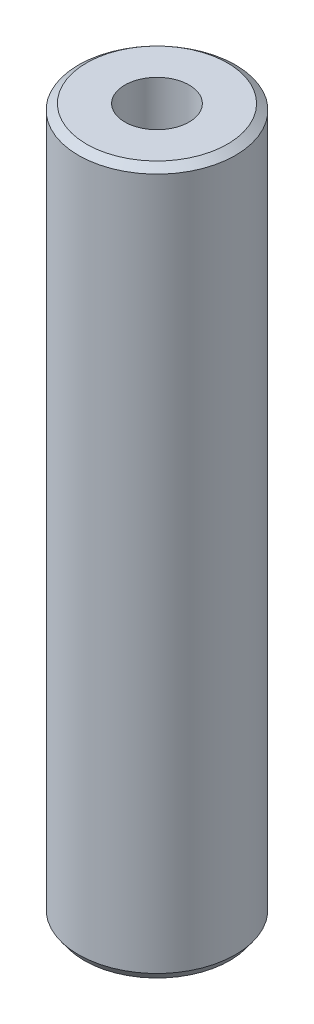
ISO-10303-21;
HEADER;
FILE_DESCRIPTION(('STEP AP214'),'2;1');
FILE_NAME('part.step','',(''),(''),'','','');
FILE_SCHEMA(('AUTOMOTIVE_DESIGN { 1 0 10303 214 1 1 1 1 }'));
ENDSEC;
DATA;
#1=APPLICATION_CONTEXT('core data for automotive mechanical design processes');
#2=APPLICATION_PROTOCOL_DEFINITION('international standard','automotive_design',2000,#1);
#3=PRODUCT_CONTEXT('',#1,'mechanical');
#4=PRODUCT('Part','Part','',(#3));
#5=PRODUCT_RELATED_PRODUCT_CATEGORY('part','',(#4));
#6=PRODUCT_DEFINITION_FORMATION('','',#4);
#7=PRODUCT_DEFINITION_CONTEXT('part definition',#1,'design');
#8=PRODUCT_DEFINITION('design','',#6,#7);
#9=PRODUCT_DEFINITION_SHAPE('','',#8);
#10=(LENGTH_UNIT() NAMED_UNIT(*) SI_UNIT(.MILLI.,.METRE.));
#11=(NAMED_UNIT(*) PLANE_ANGLE_UNIT() SI_UNIT($,.RADIAN.));
#12=(NAMED_UNIT(*) SI_UNIT($,.STERADIAN.) SOLID_ANGLE_UNIT());
#13=UNCERTAINTY_MEASURE_WITH_UNIT(LENGTH_MEASURE(1.E-05),#10,'distance_accuracy_value','');
#14=(GEOMETRIC_REPRESENTATION_CONTEXT(3) GLOBAL_UNCERTAINTY_ASSIGNED_CONTEXT((#13)) GLOBAL_UNIT_ASSIGNED_CONTEXT((#10,
#11,#12)) REPRESENTATION_CONTEXT('',''));
#15=CARTESIAN_POINT('',(0.,0.,0.));
#16=DIRECTION('',(0.,0.,1.));
#17=DIRECTION('',(1.,0.,0.));
#18=AXIS2_PLACEMENT_3D('',#15,#16,#17);
#19=CARTESIAN_POINT('',(0.,112.504714228374,0.));
#20=DIRECTION('',(0.,-1.,0.));
#21=DIRECTION('',(0.,0.,-1.));
#22=AXIS2_PLACEMENT_3D('',#19,#20,#21);
#23=CYLINDRICAL_SURFACE('',#22,12.5);
#24=CARTESIAN_POINT('',(0.,111.591022798222,0.));
#25=DIRECTION('',(0.,1.,0.));
#26=DIRECTION('',(0.,0.,1.));
#27=AXIS2_PLACEMENT_3D('',#24,#25,#26);
#28=CIRCLE('',#27,12.5);
#29=CARTESIAN_POINT('',(0.,111.591022798222,12.5));
#30=VERTEX_POINT('',#29);
#31=EDGE_CURVE('E50',#30,#30,#28,.F.);
#32=ORIENTED_EDGE('',*,*,#31,.T.);
#33=EDGE_LOOP('',(#32));
#34=FACE_BOUND('',#33,.T.);
#35=CARTESIAN_POINT('',(0.,1.27346059033918,0.));
#36=DIRECTION('',(0.,1.,0.));
#37=DIRECTION('',(0.,0.,1.));
#38=AXIS2_PLACEMENT_3D('',#35,#36,#37);
#39=CIRCLE('',#38,12.5);
#40=CARTESIAN_POINT('',(0.,1.27346059033918,12.5));
#41=VERTEX_POINT('',#40);
#42=EDGE_CURVE('E51',#41,#41,#39,.T.);
#43=ORIENTED_EDGE('',*,*,#42,.T.);
#44=EDGE_LOOP('',(#43));
#45=FACE_BOUND('',#44,.T.);
#46=ADVANCED_FACE('F39',(#34,#45),#23,.T.);
#47=CARTESIAN_POINT('',(0.,112.504714228374,0.));
#48=DIRECTION('',(0.,1.,0.));
#49=DIRECTION('',(0.,0.,1.));
#50=AXIS2_PLACEMENT_3D('',#47,#48,#49);
#51=PLANE('',#50);
#52=CARTESIAN_POINT('',(0.,112.504714228374,0.));
#53=DIRECTION('',(0.,1.,0.));
#54=DIRECTION('',(0.,0.,1.));
#55=AXIS2_PLACEMENT_3D('',#52,#53,#54);
#56=CIRCLE('',#55,11.2265394096608);
#57=CARTESIAN_POINT('',(0.,112.504714228374,11.2265394096608));
#58=VERTEX_POINT('',#57);
#59=EDGE_CURVE('E54',#58,#58,#56,.T.);
#60=ORIENTED_EDGE('',*,*,#59,.T.);
#61=EDGE_LOOP('',(#60));
#62=FACE_BOUND('',#61,.T.);
#63=CARTESIAN_POINT('',(0.,112.504714228374,0.));
#64=DIRECTION('',(0.,1.,0.));
#65=DIRECTION('',(0.,0.,1.));
#66=AXIS2_PLACEMENT_3D('',#63,#64,#65);
#67=CIRCLE('',#66,5.11905460498194);
#68=CARTESIAN_POINT('',(0.,112.504714228374,5.11905460498194));
#69=VERTEX_POINT('',#68);
#70=EDGE_CURVE('E58',#69,#69,#67,.T.);
#71=ORIENTED_EDGE('',*,*,#70,.F.);
#72=EDGE_LOOP('',(#71));
#73=FACE_BOUND('',#72,.T.);
#74=ADVANCED_FACE('F69',(#62,#73),#51,.T.);
#75=CARTESIAN_POINT('',(0.,0.,0.));
#76=DIRECTION('',(0.,1.,0.));
#77=DIRECTION('',(0.,0.,1.));
#78=AXIS2_PLACEMENT_3D('',#75,#76,#77);
#79=PLANE('',#78);
#80=CARTESIAN_POINT('',(0.,0.,0.));
#81=DIRECTION('',(0.,1.,0.));
#82=DIRECTION('',(0.,0.,1.));
#83=AXIS2_PLACEMENT_3D('',#80,#81,#82);
#84=CIRCLE('',#83,11.5863085698482);
#85=CARTESIAN_POINT('',(0.,0.,11.5863085698482));
#86=VERTEX_POINT('',#85);
#87=EDGE_CURVE('E10',#86,#86,#84,.F.);
#88=ORIENTED_EDGE('',*,*,#87,.T.);
#89=EDGE_LOOP('',(#88));
#90=FACE_BOUND('',#89,.T.);
#91=CARTESIAN_POINT('',(0.,0.,0.));
#92=DIRECTION('',(0.,1.,0.));
#93=DIRECTION('',(0.,0.,1.));
#94=AXIS2_PLACEMENT_3D('',#91,#92,#93);
#95=CIRCLE('',#94,5.11905460498194);
#96=CARTESIAN_POINT('',(0.,0.,5.11905460498194));
#97=VERTEX_POINT('',#96);
#98=EDGE_CURVE('E63',#97,#97,#95,.T.);
#99=ORIENTED_EDGE('',*,*,#98,.T.);
#100=EDGE_LOOP('',(#99));
#101=FACE_BOUND('',#100,.T.);
#102=ADVANCED_FACE('F75',(#90,#101),#79,.F.);
#103=CARTESIAN_POINT('',(0.,112.504714228374,0.));
#104=DIRECTION('',(0.,-1.,0.));
#105=DIRECTION('',(0.,0.,-1.));
#106=AXIS2_PLACEMENT_3D('',#103,#104,#105);
#107=CYLINDRICAL_SURFACE('',#106,5.11905460498194);
#108=ORIENTED_EDGE('',*,*,#70,.T.);
#109=EDGE_LOOP('',(#108));
#110=FACE_BOUND('',#109,.T.);
#111=ORIENTED_EDGE('',*,*,#98,.F.);
#112=EDGE_LOOP('',(#111));
#113=FACE_BOUND('',#112,.T.);
#114=ADVANCED_FACE('F70',(#110,#113),#107,.F.);
#115=CARTESIAN_POINT('',(0.,112.504714228374,0.));
#116=DIRECTION('',(0.,-1.,0.));
#117=DIRECTION('',(0.,0.,-1.));
#118=AXIS2_PLACEMENT_3D('',#115,#116,#117);
#119=CONICAL_SURFACE('',#118,11.2265394096608,0.948430272441637);
#120=ORIENTED_EDGE('',*,*,#31,.F.);
#121=EDGE_LOOP('',(#120));
#122=FACE_BOUND('',#121,.T.);
#123=ORIENTED_EDGE('',*,*,#59,.F.);
#124=EDGE_LOOP('',(#123));
#125=FACE_BOUND('',#124,.T.);
#126=ADVANCED_FACE('F81',(#122,#125),#119,.T.);
#127=CARTESIAN_POINT('',(0.,1.27346059033918,0.));
#128=DIRECTION('',(0.,1.,0.));
#129=DIRECTION('',(0.,0.,1.));
#130=AXIS2_PLACEMENT_3D('',#127,#128,#129);
#131=CONICAL_SURFACE('',#130,12.5,0.622366054353261);
#132=ORIENTED_EDGE('',*,*,#87,.F.);
#133=EDGE_LOOP('',(#132));
#134=FACE_BOUND('',#133,.T.);
#135=ORIENTED_EDGE('',*,*,#42,.F.);
#136=EDGE_LOOP('',(#135));
#137=FACE_BOUND('',#136,.T.);
#138=ADVANCED_FACE('F45',(#134,#137),#131,.T.);
#139=CLOSED_SHELL('',(#46,#74,#102,#114,#126,#138));
#140=MANIFOLD_SOLID_BREP('B2',#139);
#141=ADVANCED_BREP_SHAPE_REPRESENTATION('',(#18,#140),#14);
#142=SHAPE_DEFINITION_REPRESENTATION(#9,#141);
ENDSEC;
END-ISO-10303-21;
